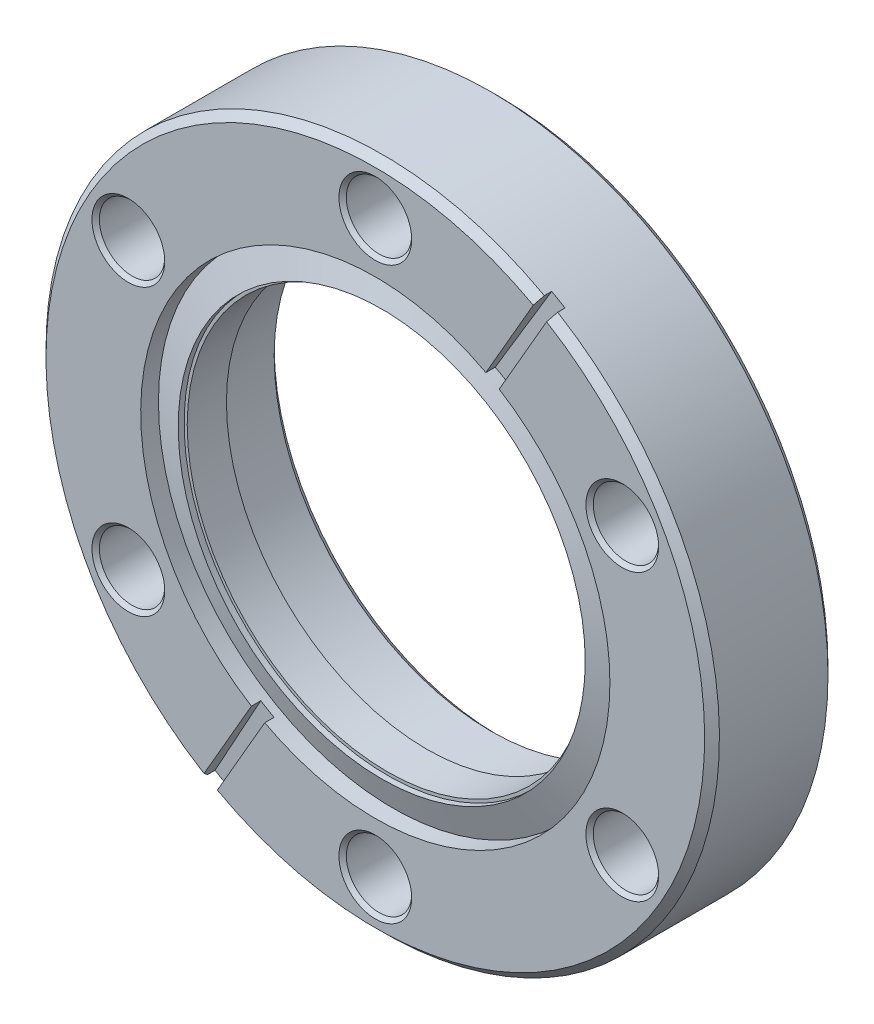
ISO-10303-21;
HEADER;
FILE_DESCRIPTION(('STEP AP214'),'2;1');
FILE_NAME('part.step','',(''),(''),'','','');
FILE_SCHEMA(('AUTOMOTIVE_DESIGN { 1 0 10303 214 1 1 1 1 }'));
ENDSEC;
DATA;
#1=APPLICATION_CONTEXT('core data for automotive mechanical design processes');
#2=APPLICATION_PROTOCOL_DEFINITION('international standard','automotive_design',2000,#1);
#3=PRODUCT_CONTEXT('',#1,'mechanical');
#4=PRODUCT('Part','Part','',(#3));
#5=PRODUCT_RELATED_PRODUCT_CATEGORY('part','',(#4));
#6=PRODUCT_DEFINITION_FORMATION('','',#4);
#7=PRODUCT_DEFINITION_CONTEXT('part definition',#1,'design');
#8=PRODUCT_DEFINITION('design','',#6,#7);
#9=PRODUCT_DEFINITION_SHAPE('','',#8);
#10=(LENGTH_UNIT() NAMED_UNIT(*) SI_UNIT(.MILLI.,.METRE.));
#11=(NAMED_UNIT(*) PLANE_ANGLE_UNIT() SI_UNIT($,.RADIAN.));
#12=(NAMED_UNIT(*) SI_UNIT($,.STERADIAN.) SOLID_ANGLE_UNIT());
#13=UNCERTAINTY_MEASURE_WITH_UNIT(LENGTH_MEASURE(1.E-05),#10,'distance_accuracy_value','');
#14=(GEOMETRIC_REPRESENTATION_CONTEXT(3) GLOBAL_UNCERTAINTY_ASSIGNED_CONTEXT((#13)) GLOBAL_UNIT_ASSIGNED_CONTEXT((#10,
#11,#12)) REPRESENTATION_CONTEXT('',''));
#15=CARTESIAN_POINT('',(0.,0.,0.));
#16=DIRECTION('',(0.,0.,1.));
#17=DIRECTION('',(1.,0.,0.));
#18=AXIS2_PLACEMENT_3D('',#15,#16,#17);
#19=CARTESIAN_POINT('',(0.,0.,-1.91651285463287));
#20=DIRECTION('',(0.,0.,1.));
#21=DIRECTION('',(1.,0.,0.));
#22=AXIS2_PLACEMENT_3D('',#19,#20,#21);
#23=CYLINDRICAL_SURFACE('',#22,20.955);
#24=CARTESIAN_POINT('',(0.,0.,-0.660399999999613));
#25=DIRECTION('',(0.,0.,-1.));
#26=DIRECTION('',(0.,-1.,0.));
#27=AXIS2_PLACEMENT_3D('',#24,#25,#26);
#28=CIRCLE('',#27,20.9550000000001);
#29=CARTESIAN_POINT('',(0.,-20.9550000000001,-0.660399999999613));
#30=VERTEX_POINT('',#29);
#31=EDGE_CURVE('E330',#30,#30,#28,.T.);
#32=ORIENTED_EDGE('',*,*,#31,.F.);
#33=EDGE_LOOP('',(#32));
#34=FACE_BOUND('',#33,.T.);
#35=CARTESIAN_POINT('',(0.,0.,-1.27));
#36=DIRECTION('',(0.,0.,1.));
#37=DIRECTION('',(1.,0.,0.));
#38=AXIS2_PLACEMENT_3D('',#35,#36,#37);
#39=CIRCLE('',#38,20.955);
#40=CARTESIAN_POINT('',(20.955,0.,-1.27));
#41=VERTEX_POINT('',#40);
#42=EDGE_CURVE('E332',#41,#41,#39,.T.);
#43=ORIENTED_EDGE('',*,*,#42,.F.);
#44=EDGE_LOOP('',(#43));
#45=FACE_BOUND('',#44,.T.);
#46=ADVANCED_FACE('F15',(#34,#45),#23,.F.);
#47=CARTESIAN_POINT('',(-11.1362923357452,-20.8761241334518,-0.9398));
#48=DIRECTION('',(-0.0261679781214693,-0.0453242676377388,0.998629534754574));
#49=DIRECTION('',(0.,-0.998971622769016,-0.0453397938045331));
#50=AXIS2_PLACEMENT_3D('',#47,#48,#49);
#51=PLANE('',#50);
#52=DIRECTION('',(-0.499314767377303,-0.864838546066885,-0.052335956242967));
#53=VECTOR('',#52,1.);
#54=CARTESIAN_POINT('',(-12.7585852175996,-20.5110178295789,-0.96573949798628));
#55=LINE('',#54,#53);
#56=CARTESIAN_POINT('',(-12.7585852175989,-20.511017829578,-0.965739497986328));
#57=VERTEX_POINT('',#56);
#58=CARTESIAN_POINT('',(-18.0183640857667,-29.6212220658211,-1.51704615798749));
#59=VERTEX_POINT('',#58);
#60=EDGE_CURVE('E122',#57,#59,#55,.T.);
#61=ORIENTED_EDGE('',*,*,#60,.T.);
#62=CARTESIAN_POINT('',(0.,0.,0.299507719817694));
#63=DIRECTION('',(-0.0261679781214693,-0.0453242676377388,0.998629534754574));
#64=DIRECTION('',(-0.499314767377261,-0.864838546066911,-0.0523359562429414));
#65=AXIS2_PLACEMENT_3D('',#62,#63,#64);
#66=ELLIPSE('',#65,34.7185806080939,34.671);
#67=CARTESIAN_POINT('',(-16.6435487572588,-30.4149720658206,-1.51704615798749));
#68=VERTEX_POINT('',#67);
#69=EDGE_CURVE('E395',#59,#68,#66,.T.);
#70=ORIENTED_EDGE('',*,*,#69,.T.);
#71=DIRECTION('',(-0.499314767377303,-0.864838546066885,-0.052335956242967));
#72=VECTOR('',#71,1.);
#73=CARTESIAN_POINT('',(-11.3837698890915,-21.3047678295781,-0.96573949798628));
#74=LINE('',#73,#72);
#75=CARTESIAN_POINT('',(-11.3837698890905,-21.3047678295783,-0.965739497986353));
#76=VERTEX_POINT('',#75);
#77=EDGE_CURVE('E329',#76,#68,#74,.T.);
#78=ORIENTED_EDGE('',*,*,#77,.F.);
#79=CARTESIAN_POINT('',(0.,0.,0.299507719817694));
#80=DIRECTION('',(-0.0261679781214693,-0.0453242676377388,0.998629534754574));
#81=DIRECTION('',(0.499314767377261,0.864838546066911,0.0523359562429414));
#82=AXIS2_PLACEMENT_3D('',#79,#80,#81);
#83=ELLIPSE('',#82,24.1885495665182,24.1554);
#84=EDGE_CURVE('E18',#76,#57,#83,.F.);
#85=ORIENTED_EDGE('',*,*,#84,.T.);
#86=EDGE_LOOP('',(#61,#70,#78,#85));
#87=FACE_BOUND('',#86,.T.);
#88=ADVANCED_FACE('F396',(#87),#51,.T.);
#89=CARTESIAN_POINT('',(12.5111076642548,20.0823741334518,-0.9398));
#90=DIRECTION('',(-0.0261679781214693,-0.0453242676377388,-0.998629534754574));
#91=DIRECTION('',(0.,0.998971622769016,-0.0453397938045331));
#92=AXIS2_PLACEMENT_3D('',#89,#90,#91);
#93=PLANE('',#92);
#94=CARTESIAN_POINT('',(0.,0.,0.29950771981774));
#95=DIRECTION('',(-0.0261679781214693,-0.0453242676377388,-0.998629534754574));
#96=DIRECTION('',(-0.499314767377261,-0.864838546066911,0.0523359562429414));
#97=AXIS2_PLACEMENT_3D('',#94,#95,#96);
#98=ELLIPSE('',#97,24.1885495665182,24.1554);
#99=CARTESIAN_POINT('',(12.7585852175989,20.511017829578,-0.965739497986305));
#100=VERTEX_POINT('',#99);
#101=CARTESIAN_POINT('',(11.3837698890905,21.3047678295783,-0.96573949798633));
#102=VERTEX_POINT('',#101);
#103=EDGE_CURVE('E333',#100,#102,#98,.F.);
#104=ORIENTED_EDGE('',*,*,#103,.F.);
#105=DIRECTION('',(0.499314767377303,0.864838546066885,-0.052335956242967));
#106=VECTOR('',#105,1.);
#107=CARTESIAN_POINT('',(12.7585852175996,20.5110178295789,-0.96573949798628));
#108=LINE('',#107,#106);
#109=CARTESIAN_POINT('',(18.0183640857667,29.6212220658211,-1.51704615798747));
#110=VERTEX_POINT('',#109);
#111=EDGE_CURVE('E117',#100,#110,#108,.T.);
#112=ORIENTED_EDGE('',*,*,#111,.T.);
#113=CARTESIAN_POINT('',(0.,0.,0.299507719817739));
#114=DIRECTION('',(-0.0261679781214693,-0.0453242676377388,-0.998629534754574));
#115=DIRECTION('',(0.499314767377261,0.864838546066911,-0.0523359562429414));
#116=AXIS2_PLACEMENT_3D('',#113,#114,#115);
#117=ELLIPSE('',#116,34.7185806080939,34.671);
#118=CARTESIAN_POINT('',(16.6435487572588,30.4149720658206,-1.51704615798747));
#119=VERTEX_POINT('',#118);
#120=EDGE_CURVE('E113',#119,#110,#117,.T.);
#121=ORIENTED_EDGE('',*,*,#120,.F.);
#122=DIRECTION('',(0.499314767377303,0.864838546066885,-0.052335956242967));
#123=VECTOR('',#122,1.);
#124=CARTESIAN_POINT('',(11.3837698890915,21.3047678295781,-0.96573949798628));
#125=LINE('',#124,#123);
#126=EDGE_CURVE('E320',#102,#119,#125,.T.);
#127=ORIENTED_EDGE('',*,*,#126,.F.);
#128=EDGE_LOOP('',(#104,#112,#121,#127));
#129=FACE_BOUND('',#128,.T.);
#130=ADVANCED_FACE('F408',(#129),#93,.F.);
#131=CARTESIAN_POINT('',(0.,0.,-1.8252503377459));
#132=DIRECTION('',(0.,0.,-1.));
#133=DIRECTION('',(-1.,0.,0.));
#134=AXIS2_PLACEMENT_3D('',#131,#132,#133);
#135=CONICAL_SURFACE('',#134,24.1553999999999,1.2217304763958);
#136=ORIENTED_EDGE('',*,*,#31,.T.);
#137=EDGE_LOOP('',(#136));
#138=FACE_BOUND('',#137,.T.);
#139=CARTESIAN_POINT('',(0.,0.,-1.82525033774552));
#140=DIRECTION('',(0.,0.,1.));
#141=DIRECTION('',(1.,0.,0.));
#142=AXIS2_PLACEMENT_3D('',#139,#140,#141);
#143=CIRCLE('',#142,24.1554);
#144=CARTESIAN_POINT('',(24.1554,0.,-1.82525033774552));
#145=VERTEX_POINT('',#144);
#146=EDGE_CURVE('E310',#145,#145,#143,.T.);
#147=ORIENTED_EDGE('',*,*,#146,.T.);
#148=EDGE_LOOP('',(#147));
#149=FACE_BOUND('',#148,.T.);
#150=ADVANCED_FACE('F402',(#138,#149),#135,.T.);
#151=CARTESIAN_POINT('',(0.,0.,-1.27));
#152=DIRECTION('',(0.,0.,1.));
#153=DIRECTION('',(1.,0.,0.));
#154=AXIS2_PLACEMENT_3D('',#151,#152,#153);
#155=PLANE('',#154);
#156=CARTESIAN_POINT('',(0.,0.,-1.27));
#157=DIRECTION('',(0.,0.,-1.));
#158=DIRECTION('',(-1.,0.,0.));
#159=AXIS2_PLACEMENT_3D('',#156,#157,#158);
#160=CIRCLE('',#159,20.6375);
#161=CARTESIAN_POINT('',(-20.6375,0.,-1.27));
#162=VERTEX_POINT('',#161);
#163=EDGE_CURVE('E308',#162,#162,#160,.T.);
#164=ORIENTED_EDGE('',*,*,#163,.T.);
#165=EDGE_LOOP('',(#164));
#166=FACE_BOUND('',#165,.T.);
#167=ORIENTED_EDGE('',*,*,#42,.T.);
#168=EDGE_LOOP('',(#167));
#169=FACE_BOUND('',#168,.T.);
#170=ADVANCED_FACE('F398',(#166,#169),#155,.T.);
#171=CARTESIAN_POINT('',(0.687407664253804,-0.396875,0.));
#172=DIRECTION('',(-0.866025403784429,0.500000000000017,0.));
#173=DIRECTION('',(-0.500000000000017,-0.866025403784429,0.));
#174=AXIS2_PLACEMENT_3D('',#171,#172,#173);
#175=PLANE('',#174);
#176=DIRECTION('',(0.35360076768896,0.612454495232614,0.70701201429618));
#177=VECTOR('',#176,1.);
#178=CARTESIAN_POINT('',(-16.6435487572581,-30.4149720658194,-0.762));
#179=LINE('',#178,#177);
#180=CARTESIAN_POINT('',(-16.6435487572581,-30.4149720658194,-0.762));
#181=VERTEX_POINT('',#180);
#182=CARTESIAN_POINT('',(-16.2624466266971,-29.7548838128196,-4.00862122973143E-12));
#183=VERTEX_POINT('',#182);
#184=EDGE_CURVE('E33',#181,#183,#179,.T.);
#185=ORIENTED_EDGE('',*,*,#184,.T.);
#186=DIRECTION('',(0.499999999999777,0.866025403784567,0.));
#187=VECTOR('',#186,1.);
#188=CARTESIAN_POINT('',(-16.2624466266952,-29.754883812821,0.));
#189=LINE('',#188,#187);
#190=CARTESIAN_POINT('',(-11.3837698890897,-21.3047678295788,0.));
#191=VERTEX_POINT('',#190);
#192=EDGE_CURVE('E307',#183,#191,#189,.T.);
#193=ORIENTED_EDGE('',*,*,#192,.T.);
#194=DIRECTION('',(0.,0.,1.));
#195=VECTOR('',#194,1.);
#196=CARTESIAN_POINT('',(-11.3837698890897,-21.3047678295788,-1.91651285463287));
#197=LINE('',#196,#195);
#198=EDGE_CURVE('E382',#191,#76,#197,.F.);
#199=ORIENTED_EDGE('',*,*,#198,.T.);
#200=ORIENTED_EDGE('',*,*,#77,.T.);
#201=DIRECTION('',(0.,0.,1.));
#202=VECTOR('',#201,1.);
#203=CARTESIAN_POINT('',(-16.6435487572581,-30.4149720658194,0.));
#204=LINE('',#203,#202);
#205=EDGE_CURVE('E327',#68,#181,#204,.T.);
#206=ORIENTED_EDGE('',*,*,#205,.T.);
#207=EDGE_LOOP('',(#185,#193,#199,#200,#206));
#208=FACE_BOUND('',#207,.T.);
#209=ADVANCED_FACE('F180',(#208),#175,.T.);
#210=CARTESIAN_POINT('',(0.687407664253804,-0.396875,0.));
#211=DIRECTION('',(0.866025403784429,-0.500000000000017,0.));
#212=DIRECTION('',(0.500000000000017,0.866025403784429,0.));
#213=AXIS2_PLACEMENT_3D('',#210,#211,#212);
#214=PLANE('',#213);
#215=DIRECTION('',(0.,0.,1.));
#216=VECTOR('',#215,1.);
#217=CARTESIAN_POINT('',(18.0183640857662,29.6212220658203,0.));
#218=LINE('',#217,#216);
#219=CARTESIAN_POINT('',(18.0183640857667,29.6212220658211,-0.761999999999097));
#220=VERTEX_POINT('',#219);
#221=EDGE_CURVE('E110',#110,#220,#218,.T.);
#222=ORIENTED_EDGE('',*,*,#221,.F.);
#223=ORIENTED_EDGE('',*,*,#111,.F.);
#224=DIRECTION('',(0.,0.,1.));
#225=VECTOR('',#224,1.);
#226=CARTESIAN_POINT('',(12.7585852175988,20.511017829578,-1.91651285463287));
#227=LINE('',#226,#225);
#228=CARTESIAN_POINT('',(12.7585852175989,20.511017829578,0.));
#229=VERTEX_POINT('',#228);
#230=EDGE_CURVE('E312',#100,#229,#227,.T.);
#231=ORIENTED_EDGE('',*,*,#230,.T.);
#232=DIRECTION('',(0.499999999999582,0.86602540378468,0.));
#233=VECTOR('',#232,1.);
#234=CARTESIAN_POINT('',(12.7585852175995,20.511017829579,0.));
#235=LINE('',#234,#233);
#236=CARTESIAN_POINT('',(17.6372619552025,28.9611338128162,-4.03828003780037E-12));
#237=VERTEX_POINT('',#236);
#238=EDGE_CURVE('E120',#229,#237,#235,.T.);
#239=ORIENTED_EDGE('',*,*,#238,.T.);
#240=CARTESIAN_POINT('',(18.0183640857668,29.6212220658212,-0.761999999999331));
#241=CARTESIAN_POINT('',(17.9548472531625,29.5112076846147,-0.634999621586678));
#242=CARTESIAN_POINT('',(17.8913303259801,29.4011931395942,-0.507999432380748));
#243=CARTESIAN_POINT('',(17.7642962824594,29.1811637219255,-0.253999432382327));
#244=CARTESIAN_POINT('',(17.700779166121,29.0711488492772,-0.126999621589835));
#245=CARTESIAN_POINT('',(17.6372619552047,28.9611338128149,-4.06682452490529E-12));
#246=B_SPLINE_CURVE_WITH_KNOTS('',3,(#240,#241,#242,#243,#244,#245),.UNSPECIFIED.,.F.,.F.,(4,2,
4),(0.,0.538887589315058,1.07777517863014),.UNSPECIFIED.);
#247=EDGE_CURVE('E102',#220,#237,#246,.T.);
#248=ORIENTED_EDGE('',*,*,#247,.F.);
#249=EDGE_LOOP('',(#222,#223,#231,#239,#248));
#250=FACE_BOUND('',#249,.T.);
#251=ADVANCED_FACE('F119',(#250),#214,.F.);
#252=CARTESIAN_POINT('',(-0.687407664253804,0.396875,0.));
#253=DIRECTION('',(-0.866025403784429,0.500000000000017,0.));
#254=DIRECTION('',(-0.500000000000017,-0.866025403784429,0.));
#255=AXIS2_PLACEMENT_3D('',#252,#253,#254);
#256=PLANE('',#255);
#257=DIRECTION('',(0.,0.,1.));
#258=VECTOR('',#257,1.);
#259=CARTESIAN_POINT('',(-18.0183640857662,-29.6212220658203,0.));
#260=LINE('',#259,#258);
#261=CARTESIAN_POINT('',(-18.0183640857667,-29.6212220658211,-0.761999999999097));
#262=VERTEX_POINT('',#261);
#263=EDGE_CURVE('E124',#59,#262,#260,.T.);
#264=ORIENTED_EDGE('',*,*,#263,.F.);
#265=ORIENTED_EDGE('',*,*,#60,.F.);
#266=DIRECTION('',(0.,0.,1.));
#267=VECTOR('',#266,1.);
#268=CARTESIAN_POINT('',(-12.7585852175988,-20.511017829578,-1.91651285463287));
#269=LINE('',#268,#267);
#270=CARTESIAN_POINT('',(-12.7585852175989,-20.511017829578,0.));
#271=VERTEX_POINT('',#270);
#272=EDGE_CURVE('E379',#57,#271,#269,.T.);
#273=ORIENTED_EDGE('',*,*,#272,.T.);
#274=DIRECTION('',(-0.499999999999582,-0.86602540378468,0.));
#275=VECTOR('',#274,1.);
#276=CARTESIAN_POINT('',(-12.7585852175995,-20.511017829579,0.));
#277=LINE('',#276,#275);
#278=CARTESIAN_POINT('',(-17.6372619552025,-28.9611338128162,-4.03711498533945E-12));
#279=VERTEX_POINT('',#278);
#280=EDGE_CURVE('E372',#271,#279,#277,.T.);
#281=ORIENTED_EDGE('',*,*,#280,.T.);
#282=CARTESIAN_POINT('',(-18.0183640857668,-29.6212220658212,-0.761999999999331));
#283=CARTESIAN_POINT('',(-17.9548472531625,-29.5112076846147,-0.634999621586678));
#284=CARTESIAN_POINT('',(-17.8913303259801,-29.4011931395942,-0.507999432380747));
#285=CARTESIAN_POINT('',(-17.7642962824594,-29.1811637219255,-0.253999432382325));
#286=CARTESIAN_POINT('',(-17.700779166121,-29.0711488492772,-0.126999621589834));
#287=CARTESIAN_POINT('',(-17.6372619552047,-28.9611338128149,-4.06485525808893E-12));
#288=B_SPLINE_CURVE_WITH_KNOTS('',3,(#282,#283,#284,#285,#286,#287),.UNSPECIFIED.,.F.,.F.,(4,2,
4),(0.,0.53888758931506,1.07777517863015),.UNSPECIFIED.);
#289=EDGE_CURVE('E133',#262,#279,#288,.T.);
#290=ORIENTED_EDGE('',*,*,#289,.F.);
#291=EDGE_LOOP('',(#264,#265,#273,#281,#290));
#292=FACE_BOUND('',#291,.T.);
#293=ADVANCED_FACE('F171',(#292),#256,.F.);
#294=CARTESIAN_POINT('',(-0.687407664253804,0.396875,0.));
#295=DIRECTION('',(0.866025403784429,-0.500000000000017,0.));
#296=DIRECTION('',(0.500000000000017,0.866025403784429,0.));
#297=AXIS2_PLACEMENT_3D('',#294,#295,#296);
#298=PLANE('',#297);
#299=DIRECTION('',(-0.35360076768896,-0.612454495232614,0.70701201429618));
#300=VECTOR('',#299,1.);
#301=CARTESIAN_POINT('',(16.6435487572581,30.4149720658194,-0.762));
#302=LINE('',#301,#300);
#303=CARTESIAN_POINT('',(16.6435487572581,30.4149720658194,-0.762));
#304=VERTEX_POINT('',#303);
#305=CARTESIAN_POINT('',(16.2624466266971,29.7548838128196,-4.00862015492989E-12));
#306=VERTEX_POINT('',#305);
#307=EDGE_CURVE('E311',#304,#306,#302,.T.);
#308=ORIENTED_EDGE('',*,*,#307,.T.);
#309=DIRECTION('',(-0.499999999999777,-0.866025403784567,0.));
#310=VECTOR('',#309,1.);
#311=CARTESIAN_POINT('',(16.2624466266952,29.754883812821,0.));
#312=LINE('',#311,#310);
#313=CARTESIAN_POINT('',(11.3837698890897,21.3047678295788,0.));
#314=VERTEX_POINT('',#313);
#315=EDGE_CURVE('E305',#306,#314,#312,.T.);
#316=ORIENTED_EDGE('',*,*,#315,.T.);
#317=DIRECTION('',(0.,0.,1.));
#318=VECTOR('',#317,1.);
#319=CARTESIAN_POINT('',(11.3837698890897,21.3047678295788,-1.91651285463287));
#320=LINE('',#319,#318);
#321=EDGE_CURVE('E318',#314,#102,#320,.F.);
#322=ORIENTED_EDGE('',*,*,#321,.T.);
#323=ORIENTED_EDGE('',*,*,#126,.T.);
#324=DIRECTION('',(0.,0.,1.));
#325=VECTOR('',#324,1.);
#326=CARTESIAN_POINT('',(16.6435487572581,30.4149720658194,0.));
#327=LINE('',#326,#325);
#328=EDGE_CURVE('E313',#119,#304,#327,.T.);
#329=ORIENTED_EDGE('',*,*,#328,.T.);
#330=EDGE_LOOP('',(#308,#316,#322,#323,#329));
#331=FACE_BOUND('',#330,.T.);
#332=ADVANCED_FACE('F168',(#331),#298,.T.);
#333=CARTESIAN_POINT('',(0.,0.,-1.91651285463287));
#334=DIRECTION('',(0.,0.,1.));
#335=DIRECTION('',(1.,0.,0.));
#336=AXIS2_PLACEMENT_3D('',#333,#334,#335);
#337=CYLINDRICAL_SURFACE('',#336,24.1554);
#338=ORIENTED_EDGE('',*,*,#146,.F.);
#339=EDGE_LOOP('',(#338));
#340=FACE_BOUND('',#339,.T.);
#341=ORIENTED_EDGE('',*,*,#198,.F.);
#342=CARTESIAN_POINT('',(0.,0.,0.));
#343=DIRECTION('',(0.,0.,1.));
#344=DIRECTION('',(1.,0.,0.));
#345=AXIS2_PLACEMENT_3D('',#342,#343,#344);
#346=CIRCLE('',#345,24.1554);
#347=EDGE_CURVE('E78',#191,#229,#346,.T.);
#348=ORIENTED_EDGE('',*,*,#347,.T.);
#349=ORIENTED_EDGE('',*,*,#230,.F.);
#350=ORIENTED_EDGE('',*,*,#103,.T.);
#351=ORIENTED_EDGE('',*,*,#321,.F.);
#352=CARTESIAN_POINT('',(0.,0.,0.));
#353=DIRECTION('',(0.,0.,1.));
#354=DIRECTION('',(1.,0.,0.));
#355=AXIS2_PLACEMENT_3D('',#352,#353,#354);
#356=CIRCLE('',#355,24.1554);
#357=EDGE_CURVE('E302',#314,#271,#356,.T.);
#358=ORIENTED_EDGE('',*,*,#357,.T.);
#359=ORIENTED_EDGE('',*,*,#272,.F.);
#360=ORIENTED_EDGE('',*,*,#84,.F.);
#361=EDGE_LOOP('',(#341,#348,#349,#350,#351,#358,#359,#360));
#362=FACE_BOUND('',#361,.T.);
#363=ADVANCED_FACE('F164',(#340,#362),#337,.F.);
#364=CARTESIAN_POINT('',(0.,0.,-1.27));
#365=DIRECTION('',(0.,0.,-1.));
#366=DIRECTION('',(-1.,0.,0.));
#367=AXIS2_PLACEMENT_3D('',#364,#365,#366);
#368=CYLINDRICAL_SURFACE('',#367,20.6375);
#369=ORIENTED_EDGE('',*,*,#163,.F.);
#370=EDGE_LOOP('',(#369));
#371=FACE_BOUND('',#370,.T.);
#372=CARTESIAN_POINT('',(0.,0.,-5.3086));
#373=DIRECTION('',(0.,0.,-1.));
#374=DIRECTION('',(-1.,0.,0.));
#375=AXIS2_PLACEMENT_3D('',#372,#373,#374);
#376=CIRCLE('',#375,20.6375);
#377=CARTESIAN_POINT('',(-20.6375,0.,-5.3086));
#378=VERTEX_POINT('',#377);
#379=EDGE_CURVE('E288',#378,#378,#376,.T.);
#380=ORIENTED_EDGE('',*,*,#379,.T.);
#381=EDGE_LOOP('',(#380));
#382=FACE_BOUND('',#381,.T.);
#383=ADVANCED_FACE('F160',(#371,#382),#368,.F.);
#384=CARTESIAN_POINT('',(0.,0.,0.));
#385=DIRECTION('',(0.,0.,-1.));
#386=DIRECTION('',(-1.,0.,0.));
#387=AXIS2_PLACEMENT_3D('',#384,#385,#386);
#388=PLANE('',#387);
#389=CARTESIAN_POINT('',(0.,-29.3624,-5.6843418860808E-11));
#390=DIRECTION('',(0.,0.,1.));
#391=DIRECTION('',(1.,0.,0.));
#392=AXIS2_PLACEMENT_3D('',#389,#390,#391);
#393=CIRCLE('',#392,3.746499999977);
#394=CARTESIAN_POINT('',(3.746499999977,-29.3624,-5.6843418860808E-11));
#395=VERTEX_POINT('',#394);
#396=EDGE_CURVE('E364',#395,#395,#393,.F.);
#397=ORIENTED_EDGE('',*,*,#396,.T.);
#398=EDGE_LOOP('',(#397));
#399=FACE_BOUND('',#398,.T.);
#400=CARTESIAN_POINT('',(25.428584316085,-14.6812,0.));
#401=DIRECTION('',(0.,0.,1.));
#402=DIRECTION('',(1.,0.,0.));
#403=AXIS2_PLACEMENT_3D('',#400,#401,#402);
#404=CIRCLE('',#403,3.74650000005169);
#405=CARTESIAN_POINT('',(29.1750843161367,-14.6812,0.));
#406=VERTEX_POINT('',#405);
#407=EDGE_CURVE('E291',#406,#406,#404,.F.);
#408=ORIENTED_EDGE('',*,*,#407,.T.);
#409=EDGE_LOOP('',(#408));
#410=FACE_BOUND('',#409,.T.);
#411=CARTESIAN_POINT('',(25.428584316085,14.6812,0.));
#412=DIRECTION('',(0.,0.,1.));
#413=DIRECTION('',(1.,0.,0.));
#414=AXIS2_PLACEMENT_3D('',#411,#412,#413);
#415=CIRCLE('',#414,3.74650000005169);
#416=CARTESIAN_POINT('',(29.1750843161367,14.6812,0.));
#417=VERTEX_POINT('',#416);
#418=EDGE_CURVE('E287',#417,#417,#415,.F.);
#419=ORIENTED_EDGE('',*,*,#418,.T.);
#420=EDGE_LOOP('',(#419));
#421=FACE_BOUND('',#420,.T.);
#422=ORIENTED_EDGE('',*,*,#238,.F.);
#423=ORIENTED_EDGE('',*,*,#347,.F.);
#424=ORIENTED_EDGE('',*,*,#192,.F.);
#425=CARTESIAN_POINT('',(0.,0.,-4.00862069233066E-12));
#426=DIRECTION('',(0.,0.,-1.));
#427=DIRECTION('',(-1.,0.,0.));
#428=AXIS2_PLACEMENT_3D('',#425,#426,#427);
#429=CIRCLE('',#428,33.9090000000041);
#430=EDGE_CURVE('E294',#237,#183,#429,.T.);
#431=ORIENTED_EDGE('',*,*,#430,.F.);
#432=EDGE_LOOP('',(#422,#423,#424,#431));
#433=FACE_BOUND('',#432,.T.);
#434=ADVANCED_FACE('F156',(#399,#410,#421,#433),#388,.F.);
#435=CARTESIAN_POINT('',(0.,0.,0.));
#436=DIRECTION('',(0.,0.,-1.));
#437=DIRECTION('',(-1.,0.,0.));
#438=AXIS2_PLACEMENT_3D('',#435,#436,#437);
#439=PLANE('',#438);
#440=CARTESIAN_POINT('',(-25.428584316085,14.6812,5.6843418860808E-11));
#441=DIRECTION('',(0.,0.,1.));
#442=DIRECTION('',(1.,0.,0.));
#443=AXIS2_PLACEMENT_3D('',#440,#441,#442);
#444=CIRCLE('',#443,3.74649999995916);
#445=CARTESIAN_POINT('',(-21.6820843161258,14.6812,5.6843418860808E-11));
#446=VERTEX_POINT('',#445);
#447=EDGE_CURVE('E358',#446,#446,#444,.F.);
#448=ORIENTED_EDGE('',*,*,#447,.T.);
#449=EDGE_LOOP('',(#448));
#450=FACE_BOUND('',#449,.T.);
#451=CARTESIAN_POINT('',(-25.428584316085,-14.6812,5.6843418860808E-11));
#452=DIRECTION('',(0.,0.,1.));
#453=DIRECTION('',(1.,0.,0.));
#454=AXIS2_PLACEMENT_3D('',#451,#452,#453);
#455=CIRCLE('',#454,3.74649999995916);
#456=CARTESIAN_POINT('',(-21.6820843161258,-14.6812,5.6843418860808E-11));
#457=VERTEX_POINT('',#456);
#458=EDGE_CURVE('E361',#457,#457,#455,.F.);
#459=ORIENTED_EDGE('',*,*,#458,.T.);
#460=EDGE_LOOP('',(#459));
#461=FACE_BOUND('',#460,.T.);
#462=CARTESIAN_POINT('',(0.,29.3624,-5.6843418860808E-11));
#463=DIRECTION('',(0.,0.,1.));
#464=DIRECTION('',(1.,0.,0.));
#465=AXIS2_PLACEMENT_3D('',#462,#463,#464);
#466=CIRCLE('',#465,3.746499999977);
#467=CARTESIAN_POINT('',(3.746499999977,29.3624,-5.6843418860808E-11));
#468=VERTEX_POINT('',#467);
#469=EDGE_CURVE('E285',#468,#468,#466,.F.);
#470=ORIENTED_EDGE('',*,*,#469,.T.);
#471=EDGE_LOOP('',(#470));
#472=FACE_BOUND('',#471,.T.);
#473=ORIENTED_EDGE('',*,*,#357,.F.);
#474=ORIENTED_EDGE('',*,*,#315,.F.);
#475=CARTESIAN_POINT('',(0.,0.,-4.00862069233066E-12));
#476=DIRECTION('',(0.,0.,-1.));
#477=DIRECTION('',(-1.,0.,0.));
#478=AXIS2_PLACEMENT_3D('',#475,#476,#477);
#479=CIRCLE('',#478,33.9090000000041);
#480=EDGE_CURVE('E299',#279,#306,#479,.T.);
#481=ORIENTED_EDGE('',*,*,#480,.F.);
#482=ORIENTED_EDGE('',*,*,#280,.F.);
#483=EDGE_LOOP('',(#473,#474,#481,#482));
#484=FACE_BOUND('',#483,.T.);
#485=ADVANCED_FACE('F152',(#450,#461,#472,#484),#439,.F.);
#486=CARTESIAN_POINT('',(0.,0.,-0.762000000000057));
#487=DIRECTION('',(0.,0.,-1.));
#488=DIRECTION('',(-1.,0.,0.));
#489=AXIS2_PLACEMENT_3D('',#486,#487,#488);
#490=CONICAL_SURFACE('',#489,34.6709999999999,0.7853981633973);
#491=CARTESIAN_POINT('',(0.,0.,-0.762));
#492=DIRECTION('',(0.,0.,-1.));
#493=DIRECTION('',(-1.,0.,0.));
#494=AXIS2_PLACEMENT_3D('',#491,#492,#493);
#495=CIRCLE('',#494,34.671);
#496=EDGE_CURVE('E107',#262,#304,#495,.T.);
#497=ORIENTED_EDGE('',*,*,#496,.F.);
#498=ORIENTED_EDGE('',*,*,#289,.T.);
#499=ORIENTED_EDGE('',*,*,#480,.T.);
#500=ORIENTED_EDGE('',*,*,#307,.F.);
#501=EDGE_LOOP('',(#497,#498,#499,#500));
#502=FACE_BOUND('',#501,.T.);
#503=ADVANCED_FACE('F147',(#502),#490,.T.);
#504=CARTESIAN_POINT('',(0.,0.,-0.762000000000057));
#505=DIRECTION('',(0.,0.,-1.));
#506=DIRECTION('',(-1.,0.,0.));
#507=AXIS2_PLACEMENT_3D('',#504,#505,#506);
#508=CONICAL_SURFACE('',#507,34.6709999999999,0.7853981633973);
#509=ORIENTED_EDGE('',*,*,#430,.T.);
#510=ORIENTED_EDGE('',*,*,#184,.F.);
#511=CARTESIAN_POINT('',(0.,0.,-0.762));
#512=DIRECTION('',(0.,0.,-1.));
#513=DIRECTION('',(-1.,0.,0.));
#514=AXIS2_PLACEMENT_3D('',#511,#512,#513);
#515=CIRCLE('',#514,34.671);
#516=EDGE_CURVE('E97',#220,#181,#515,.T.);
#517=ORIENTED_EDGE('',*,*,#516,.F.);
#518=ORIENTED_EDGE('',*,*,#247,.T.);
#519=EDGE_LOOP('',(#509,#510,#517,#518));
#520=FACE_BOUND('',#519,.T.);
#521=ADVANCED_FACE('F100',(#520),#508,.T.);
#522=CARTESIAN_POINT('',(0.,0.,-5.3086));
#523=DIRECTION('',(0.,0.,1.));
#524=DIRECTION('',(1.,0.,0.));
#525=AXIS2_PLACEMENT_3D('',#522,#523,#524);
#526=PLANE('',#525);
#527=ORIENTED_EDGE('',*,*,#379,.F.);
#528=EDGE_LOOP('',(#527));
#529=FACE_BOUND('',#528,.T.);
#530=CARTESIAN_POINT('',(0.,0.,-5.3086));
#531=DIRECTION('',(0.,0.,1.));
#532=DIRECTION('',(1.,0.,0.));
#533=AXIS2_PLACEMENT_3D('',#530,#531,#532);
#534=CIRCLE('',#533,22.352);
#535=CARTESIAN_POINT('',(22.352,0.,-5.3086));
#536=VERTEX_POINT('',#535);
#537=EDGE_CURVE('E106',#536,#536,#534,.F.);
#538=ORIENTED_EDGE('',*,*,#537,.T.);
#539=EDGE_LOOP('',(#538));
#540=FACE_BOUND('',#539,.T.);
#541=ADVANCED_FACE('F146',(#529,#540),#526,.F.);
#542=CARTESIAN_POINT('',(0.,29.3624,-5.6843418860808E-11));
#543=DIRECTION('',(0.,0.,1.));
#544=DIRECTION('',(1.,0.,0.));
#545=AXIS2_PLACEMENT_3D('',#542,#543,#544);
#546=CONICAL_SURFACE('',#545,3.746499999977,0.785398163472046);
#547=CARTESIAN_POINT('',(0.,29.3624,-0.381));
#548=DIRECTION('',(0.,0.,-1.));
#549=DIRECTION('',(-1.,0.,0.));
#550=AXIS2_PLACEMENT_3D('',#547,#548,#549);
#551=CIRCLE('',#550,3.3655);
#552=CARTESIAN_POINT('',(-3.3655,29.3624,-0.381));
#553=VERTEX_POINT('',#552);
#554=EDGE_CURVE('E282',#553,#553,#551,.T.);
#555=ORIENTED_EDGE('',*,*,#554,.T.);
#556=EDGE_LOOP('',(#555));
#557=FACE_BOUND('',#556,.T.);
#558=ORIENTED_EDGE('',*,*,#469,.F.);
#559=EDGE_LOOP('',(#558));
#560=FACE_BOUND('',#559,.T.);
#561=ADVANCED_FACE('F271',(#557,#560),#546,.F.);
#562=CARTESIAN_POINT('',(25.428584316085,14.6812,0.));
#563=DIRECTION('',(0.,0.,1.));
#564=DIRECTION('',(1.,0.,0.));
#565=AXIS2_PLACEMENT_3D('',#562,#563,#564);
#566=CONICAL_SURFACE('',#565,3.74650000005169,0.785398163397448);
#567=CARTESIAN_POINT('',(25.428584316085,14.6812,-0.381));
#568=DIRECTION('',(0.,0.,-1.));
#569=DIRECTION('',(-1.,0.,0.));
#570=AXIS2_PLACEMENT_3D('',#567,#568,#569);
#571=CIRCLE('',#570,3.3655);
#572=CARTESIAN_POINT('',(22.063084316085,14.6812,-0.381));
#573=VERTEX_POINT('',#572);
#574=EDGE_CURVE('E440',#573,#573,#571,.T.);
#575=ORIENTED_EDGE('',*,*,#574,.T.);
#576=EDGE_LOOP('',(#575));
#577=FACE_BOUND('',#576,.T.);
#578=ORIENTED_EDGE('',*,*,#418,.F.);
#579=EDGE_LOOP('',(#578));
#580=FACE_BOUND('',#579,.T.);
#581=ADVANCED_FACE('F268',(#577,#580),#566,.F.);
#582=CARTESIAN_POINT('',(25.428584316085,-14.6812,0.));
#583=DIRECTION('',(0.,0.,1.));
#584=DIRECTION('',(1.,0.,0.));
#585=AXIS2_PLACEMENT_3D('',#582,#583,#584);
#586=CONICAL_SURFACE('',#585,3.74650000005169,0.785398163397448);
#587=CARTESIAN_POINT('',(25.428584316085,-14.6812,-0.381));
#588=DIRECTION('',(0.,0.,-1.));
#589=DIRECTION('',(-1.,0.,0.));
#590=AXIS2_PLACEMENT_3D('',#587,#588,#589);
#591=CIRCLE('',#590,3.3655);
#592=CARTESIAN_POINT('',(22.063084316085,-14.6812,-0.381));
#593=VERTEX_POINT('',#592);
#594=EDGE_CURVE('E443',#593,#593,#591,.T.);
#595=ORIENTED_EDGE('',*,*,#594,.T.);
#596=EDGE_LOOP('',(#595));
#597=FACE_BOUND('',#596,.T.);
#598=ORIENTED_EDGE('',*,*,#407,.F.);
#599=EDGE_LOOP('',(#598));
#600=FACE_BOUND('',#599,.T.);
#601=ADVANCED_FACE('F264',(#597,#600),#586,.F.);
#602=CARTESIAN_POINT('',(0.,-29.3624,-5.6843418860808E-11));
#603=DIRECTION('',(0.,0.,1.));
#604=DIRECTION('',(1.,0.,0.));
#605=AXIS2_PLACEMENT_3D('',#602,#603,#604);
#606=CONICAL_SURFACE('',#605,3.746499999977,0.785398163472046);
#607=CARTESIAN_POINT('',(0.,-29.3624,-0.381));
#608=DIRECTION('',(0.,0.,-1.));
#609=DIRECTION('',(-1.,0.,0.));
#610=AXIS2_PLACEMENT_3D('',#607,#608,#609);
#611=CIRCLE('',#610,3.3655);
#612=CARTESIAN_POINT('',(-3.3655,-29.3624,-0.381));
#613=VERTEX_POINT('',#612);
#614=EDGE_CURVE('E446',#613,#613,#611,.T.);
#615=ORIENTED_EDGE('',*,*,#614,.T.);
#616=EDGE_LOOP('',(#615));
#617=FACE_BOUND('',#616,.T.);
#618=ORIENTED_EDGE('',*,*,#396,.F.);
#619=EDGE_LOOP('',(#618));
#620=FACE_BOUND('',#619,.T.);
#621=ADVANCED_FACE('F260',(#617,#620),#606,.F.);
#622=CARTESIAN_POINT('',(-25.428584316085,-14.6812,5.6843418860808E-11));
#623=DIRECTION('',(0.,0.,1.));
#624=DIRECTION('',(1.,0.,0.));
#625=AXIS2_PLACEMENT_3D('',#622,#623,#624);
#626=CONICAL_SURFACE('',#625,3.74649999995916,0.785398163322851);
#627=CARTESIAN_POINT('',(-25.428584316085,-14.6812,-0.381));
#628=DIRECTION('',(0.,0.,-1.));
#629=DIRECTION('',(-1.,0.,0.));
#630=AXIS2_PLACEMENT_3D('',#627,#628,#629);
#631=CIRCLE('',#630,3.3655);
#632=CARTESIAN_POINT('',(-28.794084316085,-14.6812,-0.381));
#633=VERTEX_POINT('',#632);
#634=EDGE_CURVE('E449',#633,#633,#631,.T.);
#635=ORIENTED_EDGE('',*,*,#634,.T.);
#636=EDGE_LOOP('',(#635));
#637=FACE_BOUND('',#636,.T.);
#638=ORIENTED_EDGE('',*,*,#458,.F.);
#639=EDGE_LOOP('',(#638));
#640=FACE_BOUND('',#639,.T.);
#641=ADVANCED_FACE('F256',(#637,#640),#626,.F.);
#642=CARTESIAN_POINT('',(-25.428584316085,14.6812,5.6843418860808E-11));
#643=DIRECTION('',(0.,0.,1.));
#644=DIRECTION('',(1.,0.,0.));
#645=AXIS2_PLACEMENT_3D('',#642,#643,#644);
#646=CONICAL_SURFACE('',#645,3.74649999995916,0.785398163322851);
#647=CARTESIAN_POINT('',(-25.428584316085,14.6812,-0.381));
#648=DIRECTION('',(0.,0.,-1.));
#649=DIRECTION('',(-1.,0.,0.));
#650=AXIS2_PLACEMENT_3D('',#647,#648,#649);
#651=CIRCLE('',#650,3.3655);
#652=CARTESIAN_POINT('',(-28.794084316085,14.6812,-0.381));
#653=VERTEX_POINT('',#652);
#654=EDGE_CURVE('E452',#653,#653,#651,.T.);
#655=ORIENTED_EDGE('',*,*,#654,.T.);
#656=EDGE_LOOP('',(#655));
#657=FACE_BOUND('',#656,.T.);
#658=ORIENTED_EDGE('',*,*,#447,.F.);
#659=EDGE_LOOP('',(#658));
#660=FACE_BOUND('',#659,.T.);
#661=ADVANCED_FACE('F252',(#657,#660),#646,.F.);
#662=CARTESIAN_POINT('',(0.,0.,0.));
#663=DIRECTION('',(0.,0.,-1.));
#664=DIRECTION('',(-1.,0.,0.));
#665=AXIS2_PLACEMENT_3D('',#662,#663,#664);
#666=CYLINDRICAL_SURFACE('',#665,34.671);
#667=CARTESIAN_POINT('',(0.,0.,-11.9379999999999));
#668=DIRECTION('',(0.,0.,1.));
#669=DIRECTION('',(0.,1.,0.));
#670=AXIS2_PLACEMENT_3D('',#667,#668,#669);
#671=CIRCLE('',#670,34.6709999999999);
#672=CARTESIAN_POINT('',(0.,34.6709999999999,-11.9379999999999));
#673=VERTEX_POINT('',#672);
#674=EDGE_CURVE('E455',#673,#673,#671,.F.);
#675=ORIENTED_EDGE('',*,*,#674,.F.);
#676=EDGE_LOOP('',(#675));
#677=FACE_BOUND('',#676,.T.);
#678=ORIENTED_EDGE('',*,*,#516,.T.);
#679=ORIENTED_EDGE('',*,*,#205,.F.);
#680=ORIENTED_EDGE('',*,*,#69,.F.);
#681=ORIENTED_EDGE('',*,*,#263,.T.);
#682=ORIENTED_EDGE('',*,*,#496,.T.);
#683=ORIENTED_EDGE('',*,*,#328,.F.);
#684=ORIENTED_EDGE('',*,*,#120,.T.);
#685=ORIENTED_EDGE('',*,*,#221,.T.);
#686=EDGE_LOOP('',(#678,#679,#680,#681,#682,#683,#684,#685));
#687=FACE_BOUND('',#686,.T.);
#688=ADVANCED_FACE('F111',(#677,#687),#666,.T.);
#689=CARTESIAN_POINT('',(0.,0.,-12.7));
#690=DIRECTION('',(0.,0.,1.));
#691=DIRECTION('',(1.,0.,0.));
#692=AXIS2_PLACEMENT_3D('',#689,#690,#691);
#693=CYLINDRICAL_SURFACE('',#692,22.352);
#694=ORIENTED_EDGE('',*,*,#537,.F.);
#695=EDGE_LOOP('',(#694));
#696=FACE_BOUND('',#695,.T.);
#697=CARTESIAN_POINT('',(0.,0.,-11.9379999999999));
#698=DIRECTION('',(0.,0.,-1.));
#699=DIRECTION('',(-1.,0.,0.));
#700=AXIS2_PLACEMENT_3D('',#697,#698,#699);
#701=CIRCLE('',#700,22.3520000000001);
#702=CARTESIAN_POINT('',(-22.3520000000001,0.,-11.9379999999999));
#703=VERTEX_POINT('',#702);
#704=EDGE_CURVE('E458',#703,#703,#701,.T.);
#705=ORIENTED_EDGE('',*,*,#704,.T.);
#706=EDGE_LOOP('',(#705));
#707=FACE_BOUND('',#706,.T.);
#708=ADVANCED_FACE('F245',(#696,#707),#693,.F.);
#709=CARTESIAN_POINT('',(0.,29.3624,0.));
#710=DIRECTION('',(0.,0.,-1.));
#711=DIRECTION('',(-1.,0.,0.));
#712=AXIS2_PLACEMENT_3D('',#709,#710,#711);
#713=CYLINDRICAL_SURFACE('',#712,3.3655);
#714=CARTESIAN_POINT('',(0.,29.3624,-12.3190000000477));
#715=DIRECTION('',(0.,0.,-1.));
#716=DIRECTION('',(-1.,0.,0.));
#717=AXIS2_PLACEMENT_3D('',#714,#715,#716);
#718=CIRCLE('',#717,3.36550000002944);
#719=CARTESIAN_POINT('',(-3.36550000002944,29.3624,-12.3190000000477));
#720=VERTEX_POINT('',#719);
#721=EDGE_CURVE('E461',#720,#720,#718,.T.);
#722=ORIENTED_EDGE('',*,*,#721,.T.);
#723=EDGE_LOOP('',(#722));
#724=FACE_BOUND('',#723,.T.);
#725=ORIENTED_EDGE('',*,*,#554,.F.);
#726=EDGE_LOOP('',(#725));
#727=FACE_BOUND('',#726,.T.);
#728=ADVANCED_FACE('F241',(#724,#727),#713,.F.);
#729=CARTESIAN_POINT('',(25.428584316085,14.6812,0.));
#730=DIRECTION('',(0.,0.,-1.));
#731=DIRECTION('',(-1.,0.,0.));
#732=AXIS2_PLACEMENT_3D('',#729,#730,#731);
#733=CYLINDRICAL_SURFACE('',#732,3.3655);
#734=CARTESIAN_POINT('',(25.428584316085,14.6812,-12.3190000000477));
#735=DIRECTION('',(0.,0.,-1.));
#736=DIRECTION('',(-1.,0.,0.));
#737=AXIS2_PLACEMENT_3D('',#734,#735,#736);
#738=CIRCLE('',#737,3.3655000000116);
#739=CARTESIAN_POINT('',(22.0630843160734,14.6812,-12.3190000000477));
#740=VERTEX_POINT('',#739);
#741=EDGE_CURVE('E464',#740,#740,#738,.T.);
#742=ORIENTED_EDGE('',*,*,#741,.T.);
#743=EDGE_LOOP('',(#742));
#744=FACE_BOUND('',#743,.T.);
#745=ORIENTED_EDGE('',*,*,#574,.F.);
#746=EDGE_LOOP('',(#745));
#747=FACE_BOUND('',#746,.T.);
#748=ADVANCED_FACE('F237',(#744,#747),#733,.F.);
#749=CARTESIAN_POINT('',(25.428584316085,-14.6812,0.));
#750=DIRECTION('',(0.,0.,-1.));
#751=DIRECTION('',(-1.,0.,0.));
#752=AXIS2_PLACEMENT_3D('',#749,#750,#751);
#753=CYLINDRICAL_SURFACE('',#752,3.3655);
#754=CARTESIAN_POINT('',(25.428584316085,-14.6812,-12.3190000000477));
#755=DIRECTION('',(0.,0.,-1.));
#756=DIRECTION('',(-1.,0.,0.));
#757=AXIS2_PLACEMENT_3D('',#754,#755,#756);
#758=CIRCLE('',#757,3.3655000000116);
#759=CARTESIAN_POINT('',(22.0630843160734,-14.6812,-12.3190000000477));
#760=VERTEX_POINT('',#759);
#761=EDGE_CURVE('E467',#760,#760,#758,.T.);
#762=ORIENTED_EDGE('',*,*,#761,.T.);
#763=EDGE_LOOP('',(#762));
#764=FACE_BOUND('',#763,.T.);
#765=ORIENTED_EDGE('',*,*,#594,.F.);
#766=EDGE_LOOP('',(#765));
#767=FACE_BOUND('',#766,.T.);
#768=ADVANCED_FACE('F233',(#764,#767),#753,.F.);
#769=CARTESIAN_POINT('',(0.,-29.3624,0.));
#770=DIRECTION('',(0.,0.,-1.));
#771=DIRECTION('',(-1.,0.,0.));
#772=AXIS2_PLACEMENT_3D('',#769,#770,#771);
#773=CYLINDRICAL_SURFACE('',#772,3.3655);
#774=CARTESIAN_POINT('',(0.,-29.3624,-12.3190000000477));
#775=DIRECTION('',(0.,0.,-1.));
#776=DIRECTION('',(-1.,0.,0.));
#777=AXIS2_PLACEMENT_3D('',#774,#775,#776);
#778=CIRCLE('',#777,3.36550000002944);
#779=CARTESIAN_POINT('',(-3.36550000002944,-29.3624,-12.3190000000477));
#780=VERTEX_POINT('',#779);
#781=EDGE_CURVE('E470',#780,#780,#778,.T.);
#782=ORIENTED_EDGE('',*,*,#781,.T.);
#783=EDGE_LOOP('',(#782));
#784=FACE_BOUND('',#783,.T.);
#785=ORIENTED_EDGE('',*,*,#614,.F.);
#786=EDGE_LOOP('',(#785));
#787=FACE_BOUND('',#786,.T.);
#788=ADVANCED_FACE('F229',(#784,#787),#773,.F.);
#789=CARTESIAN_POINT('',(-25.428584316085,-14.6812,0.));
#790=DIRECTION('',(0.,0.,-1.));
#791=DIRECTION('',(-1.,0.,0.));
#792=AXIS2_PLACEMENT_3D('',#789,#790,#791);
#793=CYLINDRICAL_SURFACE('',#792,3.3655);
#794=CARTESIAN_POINT('',(-25.428584316085,-14.6812,-12.318999999934));
#795=DIRECTION('',(0.,0.,-1.));
#796=DIRECTION('',(-1.,0.,0.));
#797=AXIS2_PLACEMENT_3D('',#794,#795,#796);
#798=CIRCLE('',#797,3.36549999999044);
#799=CARTESIAN_POINT('',(-28.7940843160754,-14.6812,-12.318999999934));
#800=VERTEX_POINT('',#799);
#801=EDGE_CURVE('E473',#800,#800,#798,.T.);
#802=ORIENTED_EDGE('',*,*,#801,.T.);
#803=EDGE_LOOP('',(#802));
#804=FACE_BOUND('',#803,.T.);
#805=ORIENTED_EDGE('',*,*,#634,.F.);
#806=EDGE_LOOP('',(#805));
#807=FACE_BOUND('',#806,.T.);
#808=ADVANCED_FACE('F225',(#804,#807),#793,.F.);
#809=CARTESIAN_POINT('',(-25.428584316085,14.6812,0.));
#810=DIRECTION('',(0.,0.,-1.));
#811=DIRECTION('',(-1.,0.,0.));
#812=AXIS2_PLACEMENT_3D('',#809,#810,#811);
#813=CYLINDRICAL_SURFACE('',#812,3.3655);
#814=CARTESIAN_POINT('',(-25.428584316085,14.6812,-12.318999999934));
#815=DIRECTION('',(0.,0.,-1.));
#816=DIRECTION('',(-1.,0.,0.));
#817=AXIS2_PLACEMENT_3D('',#814,#815,#816);
#818=CIRCLE('',#817,3.36549999999044);
#819=CARTESIAN_POINT('',(-28.7940843160754,14.6812,-12.318999999934));
#820=VERTEX_POINT('',#819);
#821=EDGE_CURVE('E355',#820,#820,#818,.T.);
#822=ORIENTED_EDGE('',*,*,#821,.T.);
#823=EDGE_LOOP('',(#822));
#824=FACE_BOUND('',#823,.T.);
#825=ORIENTED_EDGE('',*,*,#654,.F.);
#826=EDGE_LOOP('',(#825));
#827=FACE_BOUND('',#826,.T.);
#828=ADVANCED_FACE('F221',(#824,#827),#813,.F.);
#829=CARTESIAN_POINT('',(0.,0.,-11.9379999999999));
#830=DIRECTION('',(0.,0.,1.));
#831=DIRECTION('',(1.,0.,0.));
#832=AXIS2_PLACEMENT_3D('',#829,#830,#831);
#833=CONICAL_SURFACE('',#832,34.6709999999999,0.7853981633973);
#834=ORIENTED_EDGE('',*,*,#674,.T.);
#835=EDGE_LOOP('',(#834));
#836=FACE_BOUND('',#835,.T.);
#837=CARTESIAN_POINT('',(0.,0.,-12.7000000000001));
#838=DIRECTION('',(0.,0.,1.));
#839=DIRECTION('',(1.,0.,0.));
#840=AXIS2_PLACEMENT_3D('',#837,#838,#839);
#841=CIRCLE('',#840,33.909);
#842=CARTESIAN_POINT('',(33.909,0.,-12.7000000000001));
#843=VERTEX_POINT('',#842);
#844=EDGE_CURVE('E352',#843,#843,#841,.F.);
#845=ORIENTED_EDGE('',*,*,#844,.F.);
#846=EDGE_LOOP('',(#845));
#847=FACE_BOUND('',#846,.T.);
#848=ADVANCED_FACE('F217',(#836,#847),#833,.T.);
#849=CARTESIAN_POINT('',(0.,0.,-12.7000000000001));
#850=DIRECTION('',(0.,0.,-1.));
#851=DIRECTION('',(-1.,0.,0.));
#852=AXIS2_PLACEMENT_3D('',#849,#850,#851);
#853=CONICAL_SURFACE('',#852,23.1139999999999,0.785398163397298);
#854=ORIENTED_EDGE('',*,*,#704,.F.);
#855=EDGE_LOOP('',(#854));
#856=FACE_BOUND('',#855,.T.);
#857=CARTESIAN_POINT('',(0.,0.,-12.7000000000001));
#858=DIRECTION('',(0.,0.,-1.));
#859=DIRECTION('',(-1.,0.,0.));
#860=AXIS2_PLACEMENT_3D('',#857,#858,#859);
#861=CIRCLE('',#860,23.1139999999999);
#862=CARTESIAN_POINT('',(-23.1139999999999,0.,-12.7000000000001));
#863=VERTEX_POINT('',#862);
#864=EDGE_CURVE('E349',#863,#863,#861,.F.);
#865=ORIENTED_EDGE('',*,*,#864,.F.);
#866=EDGE_LOOP('',(#865));
#867=FACE_BOUND('',#866,.T.);
#868=ADVANCED_FACE('F213',(#856,#867),#853,.F.);
#869=CARTESIAN_POINT('',(0.,29.3624,-12.6999999999953));
#870=DIRECTION('',(0.,0.,-1.));
#871=DIRECTION('',(-1.,0.,0.));
#872=AXIS2_PLACEMENT_3D('',#869,#870,#871);
#873=CONICAL_SURFACE('',#872,3.74650000003385,0.785398163472046);
#874=ORIENTED_EDGE('',*,*,#721,.F.);
#875=EDGE_LOOP('',(#874));
#876=FACE_BOUND('',#875,.T.);
#877=CARTESIAN_POINT('',(0.,29.3624,-12.6999999999953));
#878=DIRECTION('',(0.,0.,-1.));
#879=DIRECTION('',(-1.,0.,0.));
#880=AXIS2_PLACEMENT_3D('',#877,#878,#879);
#881=CIRCLE('',#880,3.74650000003385);
#882=CARTESIAN_POINT('',(-3.74650000003385,29.3624,-12.6999999999953));
#883=VERTEX_POINT('',#882);
#884=EDGE_CURVE('E346',#883,#883,#881,.F.);
#885=ORIENTED_EDGE('',*,*,#884,.F.);
#886=EDGE_LOOP('',(#885));
#887=FACE_BOUND('',#886,.T.);
#888=ADVANCED_FACE('F209',(#876,#887),#873,.F.);
#889=CARTESIAN_POINT('',(25.428584316085,14.6812,-12.6999999999953));
#890=DIRECTION('',(0.,0.,-1.));
#891=DIRECTION('',(-1.,0.,0.));
#892=AXIS2_PLACEMENT_3D('',#889,#890,#891);
#893=CONICAL_SURFACE('',#892,3.746500000016,0.785398163472046);
#894=ORIENTED_EDGE('',*,*,#741,.F.);
#895=EDGE_LOOP('',(#894));
#896=FACE_BOUND('',#895,.T.);
#897=CARTESIAN_POINT('',(25.428584316085,14.6812,-12.7000000000131));
#898=DIRECTION('',(0.,0.,-1.));
#899=DIRECTION('',(-1.,0.,0.));
#900=AXIS2_PLACEMENT_3D('',#897,#898,#899);
#901=CIRCLE('',#900,3.74650000003385);
#902=CARTESIAN_POINT('',(21.6820843160512,14.6812,-12.7000000000131));
#903=VERTEX_POINT('',#902);
#904=EDGE_CURVE('E343',#903,#903,#901,.F.);
#905=ORIENTED_EDGE('',*,*,#904,.F.);
#906=EDGE_LOOP('',(#905));
#907=FACE_BOUND('',#906,.T.);
#908=ADVANCED_FACE('F205',(#896,#907),#893,.F.);
#909=CARTESIAN_POINT('',(25.428584316085,-14.6812,-12.6999999999953));
#910=DIRECTION('',(0.,0.,-1.));
#911=DIRECTION('',(-1.,0.,0.));
#912=AXIS2_PLACEMENT_3D('',#909,#910,#911);
#913=CONICAL_SURFACE('',#912,3.746500000016,0.785398163472046);
#914=ORIENTED_EDGE('',*,*,#761,.F.);
#915=EDGE_LOOP('',(#914));
#916=FACE_BOUND('',#915,.T.);
#917=CARTESIAN_POINT('',(25.428584316085,-14.6812,-12.7000000000131));
#918=DIRECTION('',(0.,0.,-1.));
#919=DIRECTION('',(-1.,0.,0.));
#920=AXIS2_PLACEMENT_3D('',#917,#918,#919);
#921=CIRCLE('',#920,3.74650000003385);
#922=CARTESIAN_POINT('',(21.6820843160512,-14.6812,-12.7000000000131));
#923=VERTEX_POINT('',#922);
#924=EDGE_CURVE('E340',#923,#923,#921,.F.);
#925=ORIENTED_EDGE('',*,*,#924,.F.);
#926=EDGE_LOOP('',(#925));
#927=FACE_BOUND('',#926,.T.);
#928=ADVANCED_FACE('F201',(#916,#927),#913,.F.);
#929=CARTESIAN_POINT('',(0.,-29.3624,-12.6999999999953));
#930=DIRECTION('',(0.,0.,-1.));
#931=DIRECTION('',(-1.,0.,0.));
#932=AXIS2_PLACEMENT_3D('',#929,#930,#931);
#933=CONICAL_SURFACE('',#932,3.74650000003385,0.785398163472046);
#934=ORIENTED_EDGE('',*,*,#781,.F.);
#935=EDGE_LOOP('',(#934));
#936=FACE_BOUND('',#935,.T.);
#937=CARTESIAN_POINT('',(0.,-29.3624,-12.6999999999953));
#938=DIRECTION('',(0.,0.,-1.));
#939=DIRECTION('',(-1.,0.,0.));
#940=AXIS2_PLACEMENT_3D('',#937,#938,#939);
#941=CIRCLE('',#940,3.74650000003385);
#942=CARTESIAN_POINT('',(-3.74650000003385,-29.3624,-12.6999999999953));
#943=VERTEX_POINT('',#942);
#944=EDGE_CURVE('E337',#943,#943,#941,.F.);
#945=ORIENTED_EDGE('',*,*,#944,.F.);
#946=EDGE_LOOP('',(#945));
#947=FACE_BOUND('',#946,.T.);
#948=ADVANCED_FACE('F197',(#936,#947),#933,.F.);
#949=CARTESIAN_POINT('',(-25.428584316085,-14.6812,-12.6999999999953));
#950=DIRECTION('',(0.,0.,-1.));
#951=DIRECTION('',(-1.,0.,0.));
#952=AXIS2_PLACEMENT_3D('',#949,#950,#951);
#953=CONICAL_SURFACE('',#952,3.74650000005169,0.785398163397448);
#954=ORIENTED_EDGE('',*,*,#801,.F.);
#955=EDGE_LOOP('',(#954));
#956=FACE_BOUND('',#955,.T.);
#957=CARTESIAN_POINT('',(-25.428584316085,-14.6812,-12.6999999999953));
#958=DIRECTION('',(0.,0.,-1.));
#959=DIRECTION('',(-1.,0.,0.));
#960=AXIS2_PLACEMENT_3D('',#957,#958,#959);
#961=CIRCLE('',#960,3.74650000005169);
#962=CARTESIAN_POINT('',(-29.1750843161367,-14.6812,-12.6999999999953));
#963=VERTEX_POINT('',#962);
#964=EDGE_CURVE('E24',#963,#963,#961,.F.);
#965=ORIENTED_EDGE('',*,*,#964,.F.);
#966=EDGE_LOOP('',(#965));
#967=FACE_BOUND('',#966,.T.);
#968=ADVANCED_FACE('F190',(#956,#967),#953,.F.);
#969=CARTESIAN_POINT('',(-25.428584316085,14.6812,-12.6999999999953));
#970=DIRECTION('',(0.,0.,-1.));
#971=DIRECTION('',(-1.,0.,0.));
#972=AXIS2_PLACEMENT_3D('',#969,#970,#971);
#973=CONICAL_SURFACE('',#972,3.74650000005169,0.785398163397448);
#974=ORIENTED_EDGE('',*,*,#821,.F.);
#975=EDGE_LOOP('',(#974));
#976=FACE_BOUND('',#975,.T.);
#977=CARTESIAN_POINT('',(-25.428584316085,14.6812,-12.6999999999953));
#978=DIRECTION('',(0.,0.,-1.));
#979=DIRECTION('',(-1.,0.,0.));
#980=AXIS2_PLACEMENT_3D('',#977,#978,#979);
#981=CIRCLE('',#980,3.74650000005169);
#982=CARTESIAN_POINT('',(-29.1750843161367,14.6812,-12.6999999999953));
#983=VERTEX_POINT('',#982);
#984=EDGE_CURVE('E10',#983,#983,#981,.F.);
#985=ORIENTED_EDGE('',*,*,#984,.F.);
#986=EDGE_LOOP('',(#985));
#987=FACE_BOUND('',#986,.T.);
#988=ADVANCED_FACE('F184',(#976,#987),#973,.F.);
#989=CARTESIAN_POINT('',(0.,0.,-12.7));
#990=DIRECTION('',(0.,0.,-1.));
#991=DIRECTION('',(-1.,0.,0.));
#992=AXIS2_PLACEMENT_3D('',#989,#990,#991);
#993=PLANE('',#992);
#994=ORIENTED_EDGE('',*,*,#984,.T.);
#995=EDGE_LOOP('',(#994));
#996=FACE_BOUND('',#995,.T.);
#997=ORIENTED_EDGE('',*,*,#964,.T.);
#998=EDGE_LOOP('',(#997));
#999=FACE_BOUND('',#998,.T.);
#1000=ORIENTED_EDGE('',*,*,#944,.T.);
#1001=EDGE_LOOP('',(#1000));
#1002=FACE_BOUND('',#1001,.T.);
#1003=ORIENTED_EDGE('',*,*,#924,.T.);
#1004=EDGE_LOOP('',(#1003));
#1005=FACE_BOUND('',#1004,.T.);
#1006=ORIENTED_EDGE('',*,*,#904,.T.);
#1007=EDGE_LOOP('',(#1006));
#1008=FACE_BOUND('',#1007,.T.);
#1009=ORIENTED_EDGE('',*,*,#884,.T.);
#1010=EDGE_LOOP('',(#1009));
#1011=FACE_BOUND('',#1010,.T.);
#1012=ORIENTED_EDGE('',*,*,#864,.T.);
#1013=EDGE_LOOP('',(#1012));
#1014=FACE_BOUND('',#1013,.T.);
#1015=ORIENTED_EDGE('',*,*,#844,.T.);
#1016=EDGE_LOOP('',(#1015));
#1017=FACE_BOUND('',#1016,.T.);
#1018=ADVANCED_FACE('F182',(#996,#999,#1002,#1005,#1008,#1011,#1014,#1017),#993,.T.);
#1019=CLOSED_SHELL('',(#46,#88,#130,#150,#170,#209,#251,#293,#332,#363,#383,#434,#485,#503,#521,
#541,#561,#581,#601,#621,#641,#661,#688,#708,#728,#748,#768,#788,#808,#828,#848,#868,#888,#908,
#928,#948,#968,#988,#1018));
#1020=MANIFOLD_SOLID_BREP('B1',#1019);
#1021=ADVANCED_BREP_SHAPE_REPRESENTATION('',(#18,#1020),#14);
#1022=SHAPE_DEFINITION_REPRESENTATION(#9,#1021);
ENDSEC;
END-ISO-10303-21;
